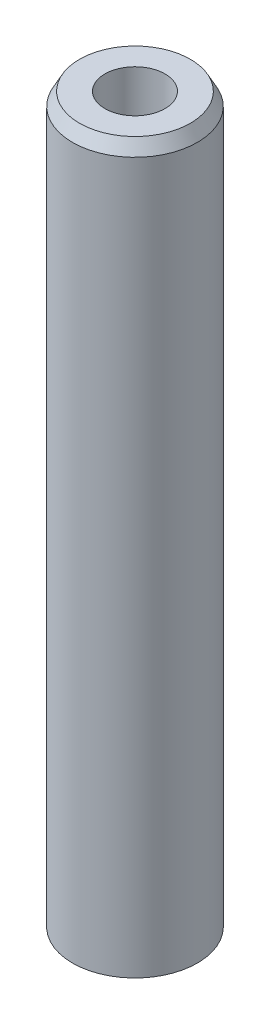
ISO-10303-21;
HEADER;
FILE_DESCRIPTION(('STEP AP214'),'2;1');
FILE_NAME('part.step','',(''),(''),'','','');
FILE_SCHEMA(('AUTOMOTIVE_DESIGN { 1 0 10303 214 1 1 1 1 }'));
ENDSEC;
DATA;
#1=APPLICATION_CONTEXT('core data for automotive mechanical design processes');
#2=APPLICATION_PROTOCOL_DEFINITION('international standard','automotive_design',2000,#1);
#3=PRODUCT_CONTEXT('',#1,'mechanical');
#4=PRODUCT('Part','Part','',(#3));
#5=PRODUCT_RELATED_PRODUCT_CATEGORY('part','',(#4));
#6=PRODUCT_DEFINITION_FORMATION('','',#4);
#7=PRODUCT_DEFINITION_CONTEXT('part definition',#1,'design');
#8=PRODUCT_DEFINITION('design','',#6,#7);
#9=PRODUCT_DEFINITION_SHAPE('','',#8);
#10=(LENGTH_UNIT() NAMED_UNIT(*) SI_UNIT(.MILLI.,.METRE.));
#11=(NAMED_UNIT(*) PLANE_ANGLE_UNIT() SI_UNIT($,.RADIAN.));
#12=(NAMED_UNIT(*) SI_UNIT($,.STERADIAN.) SOLID_ANGLE_UNIT());
#13=UNCERTAINTY_MEASURE_WITH_UNIT(LENGTH_MEASURE(1.E-05),#10,'distance_accuracy_value','');
#14=(GEOMETRIC_REPRESENTATION_CONTEXT(3) GLOBAL_UNCERTAINTY_ASSIGNED_CONTEXT((#13)) GLOBAL_UNIT_ASSIGNED_CONTEXT((#10,
#11,#12)) REPRESENTATION_CONTEXT('',''));
#15=CARTESIAN_POINT('',(0.,0.,0.));
#16=DIRECTION('',(0.,0.,1.));
#17=DIRECTION('',(1.,0.,0.));
#18=AXIS2_PLACEMENT_3D('',#15,#16,#17);
#19=CARTESIAN_POINT('',(0.,204.780357031891,0.));
#20=DIRECTION('',(0.,-1.,0.));
#21=DIRECTION('',(0.,0.,-1.));
#22=AXIS2_PLACEMENT_3D('',#19,#20,#21);
#23=CYLINDRICAL_SURFACE('',#22,17.5);
#24=CARTESIAN_POINT('',(0.,201.12175545577,0.));
#25=DIRECTION('',(0.,1.,0.));
#26=DIRECTION('',(0.,0.,1.));
#27=AXIS2_PLACEMENT_3D('',#24,#25,#26);
#28=CIRCLE('',#27,17.5);
#29=CARTESIAN_POINT('',(0.,201.12175545577,17.5));
#30=VERTEX_POINT('',#29);
#31=EDGE_CURVE('E50',#30,#30,#28,.F.);
#32=ORIENTED_EDGE('',*,*,#31,.T.);
#33=EDGE_LOOP('',(#32));
#34=FACE_BOUND('',#33,.T.);
#35=CARTESIAN_POINT('',(0.,1.96434472375101,0.));
#36=DIRECTION('',(0.,1.,0.));
#37=DIRECTION('',(0.,0.,1.));
#38=AXIS2_PLACEMENT_3D('',#35,#36,#37);
#39=CIRCLE('',#38,17.5);
#40=CARTESIAN_POINT('',(0.,1.96434472375101,17.5));
#41=VERTEX_POINT('',#40);
#42=EDGE_CURVE('E51',#41,#41,#39,.T.);
#43=ORIENTED_EDGE('',*,*,#42,.T.);
#44=EDGE_LOOP('',(#43));
#45=FACE_BOUND('',#44,.T.);
#46=ADVANCED_FACE('F39',(#34,#45),#23,.T.);
#47=CARTESIAN_POINT('',(0.,204.780357031891,0.));
#48=DIRECTION('',(0.,1.,0.));
#49=DIRECTION('',(0.,0.,1.));
#50=AXIS2_PLACEMENT_3D('',#47,#48,#49);
#51=PLANE('',#50);
#52=CARTESIAN_POINT('',(0.,204.780357031891,0.));
#53=DIRECTION('',(0.,1.,0.));
#54=DIRECTION('',(0.,0.,1.));
#55=AXIS2_PLACEMENT_3D('',#52,#53,#54);
#56=CIRCLE('',#55,15.535655276249);
#57=CARTESIAN_POINT('',(0.,204.780357031891,15.535655276249));
#58=VERTEX_POINT('',#57);
#59=EDGE_CURVE('E54',#58,#58,#56,.T.);
#60=ORIENTED_EDGE('',*,*,#59,.T.);
#61=EDGE_LOOP('',(#60));
#62=FACE_BOUND('',#61,.T.);
#63=CARTESIAN_POINT('',(0.,204.780357031891,0.));
#64=DIRECTION('',(0.,1.,0.));
#65=DIRECTION('',(0.,0.,1.));
#66=AXIS2_PLACEMENT_3D('',#63,#64,#65);
#67=CIRCLE('',#66,8.42965073895799);
#68=CARTESIAN_POINT('',(0.,204.780357031891,8.42965073895799));
#69=VERTEX_POINT('',#68);
#70=EDGE_CURVE('E58',#69,#69,#67,.T.);
#71=ORIENTED_EDGE('',*,*,#70,.F.);
#72=EDGE_LOOP('',(#71));
#73=FACE_BOUND('',#72,.T.);
#74=ADVANCED_FACE('F69',(#62,#73),#51,.T.);
#75=CARTESIAN_POINT('',(0.,0.,0.));
#76=DIRECTION('',(0.,1.,0.));
#77=DIRECTION('',(0.,0.,1.));
#78=AXIS2_PLACEMENT_3D('',#75,#76,#77);
#79=PLANE('',#78);
#80=CARTESIAN_POINT('',(0.,0.,0.));
#81=DIRECTION('',(0.,1.,0.));
#82=DIRECTION('',(0.,0.,1.));
#83=AXIS2_PLACEMENT_3D('',#80,#81,#82);
#84=CIRCLE('',#83,13.8413984238791);
#85=CARTESIAN_POINT('',(0.,0.,13.8413984238791));
#86=VERTEX_POINT('',#85);
#87=EDGE_CURVE('E10',#86,#86,#84,.F.);
#88=ORIENTED_EDGE('',*,*,#87,.T.);
#89=EDGE_LOOP('',(#88));
#90=FACE_BOUND('',#89,.T.);
#91=CARTESIAN_POINT('',(0.,0.,0.));
#92=DIRECTION('',(0.,1.,0.));
#93=DIRECTION('',(0.,0.,1.));
#94=AXIS2_PLACEMENT_3D('',#91,#92,#93);
#95=CIRCLE('',#94,8.42965073895799);
#96=CARTESIAN_POINT('',(0.,0.,8.42965073895799));
#97=VERTEX_POINT('',#96);
#98=EDGE_CURVE('E63',#97,#97,#95,.T.);
#99=ORIENTED_EDGE('',*,*,#98,.T.);
#100=EDGE_LOOP('',(#99));
#101=FACE_BOUND('',#100,.T.);
#102=ADVANCED_FACE('F75',(#90,#101),#79,.F.);
#103=CARTESIAN_POINT('',(0.,204.780357031891,0.));
#104=DIRECTION('',(0.,-1.,0.));
#105=DIRECTION('',(0.,0.,-1.));
#106=AXIS2_PLACEMENT_3D('',#103,#104,#105);
#107=CYLINDRICAL_SURFACE('',#106,8.42965073895799);
#108=ORIENTED_EDGE('',*,*,#70,.T.);
#109=EDGE_LOOP('',(#108));
#110=FACE_BOUND('',#109,.T.);
#111=ORIENTED_EDGE('',*,*,#98,.F.);
#112=EDGE_LOOP('',(#111));
#113=FACE_BOUND('',#112,.T.);
#114=ADVANCED_FACE('F70',(#110,#113),#107,.F.);
#115=CARTESIAN_POINT('',(0.,204.780357031891,0.));
#116=DIRECTION('',(0.,-1.,0.));
#117=DIRECTION('',(0.,0.,-1.));
#118=AXIS2_PLACEMENT_3D('',#115,#116,#117);
#119=CONICAL_SURFACE('',#118,15.535655276249,0.492738842371977);
#120=ORIENTED_EDGE('',*,*,#31,.F.);
#121=EDGE_LOOP('',(#120));
#122=FACE_BOUND('',#121,.T.);
#123=ORIENTED_EDGE('',*,*,#59,.F.);
#124=EDGE_LOOP('',(#123));
#125=FACE_BOUND('',#124,.T.);
#126=ADVANCED_FACE('F81',(#122,#125),#119,.T.);
#127=CARTESIAN_POINT('',(0.,1.96434472375101,0.));
#128=DIRECTION('',(0.,1.,0.));
#129=DIRECTION('',(0.,0.,1.));
#130=AXIS2_PLACEMENT_3D('',#127,#128,#129);
#131=CONICAL_SURFACE('',#130,17.5,1.07805748442292);
#132=ORIENTED_EDGE('',*,*,#87,.F.);
#133=EDGE_LOOP('',(#132));
#134=FACE_BOUND('',#133,.T.);
#135=ORIENTED_EDGE('',*,*,#42,.F.);
#136=EDGE_LOOP('',(#135));
#137=FACE_BOUND('',#136,.T.);
#138=ADVANCED_FACE('F45',(#134,#137),#131,.T.);
#139=CLOSED_SHELL('',(#46,#74,#102,#114,#126,#138));
#140=MANIFOLD_SOLID_BREP('B2',#139);
#141=ADVANCED_BREP_SHAPE_REPRESENTATION('',(#18,#140),#14);
#142=SHAPE_DEFINITION_REPRESENTATION(#9,#141);
ENDSEC;
END-ISO-10303-21;
